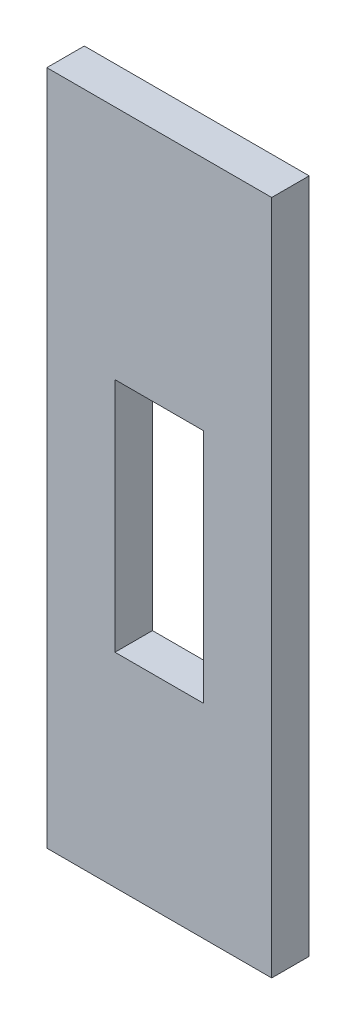
ISO-10303-21;
HEADER;
FILE_DESCRIPTION(('STEP AP214'),'2;1');
FILE_NAME('part.step','',(''),(''),'','','');
FILE_SCHEMA(('AUTOMOTIVE_DESIGN { 1 0 10303 214 1 1 1 1 }'));
ENDSEC;
DATA;
#1=APPLICATION_CONTEXT('core data for automotive mechanical design processes');
#2=APPLICATION_PROTOCOL_DEFINITION('international standard','automotive_design',2000,#1);
#3=PRODUCT_CONTEXT('',#1,'mechanical');
#4=PRODUCT('Part','Part','',(#3));
#5=PRODUCT_RELATED_PRODUCT_CATEGORY('part','',(#4));
#6=PRODUCT_DEFINITION_FORMATION('','',#4);
#7=PRODUCT_DEFINITION_CONTEXT('part definition',#1,'design');
#8=PRODUCT_DEFINITION('design','',#6,#7);
#9=PRODUCT_DEFINITION_SHAPE('','',#8);
#10=(LENGTH_UNIT() NAMED_UNIT(*) SI_UNIT(.MILLI.,.METRE.));
#11=(NAMED_UNIT(*) PLANE_ANGLE_UNIT() SI_UNIT($,.RADIAN.));
#12=(NAMED_UNIT(*) SI_UNIT($,.STERADIAN.) SOLID_ANGLE_UNIT());
#13=UNCERTAINTY_MEASURE_WITH_UNIT(LENGTH_MEASURE(1.E-05),#10,'distance_accuracy_value','');
#14=(GEOMETRIC_REPRESENTATION_CONTEXT(3) GLOBAL_UNCERTAINTY_ASSIGNED_CONTEXT((#13)) GLOBAL_UNIT_ASSIGNED_CONTEXT((#10,
#11,#12)) REPRESENTATION_CONTEXT('',''));
#15=CARTESIAN_POINT('',(0.,0.,0.));
#16=DIRECTION('',(0.,0.,1.));
#17=DIRECTION('',(1.,0.,0.));
#18=AXIS2_PLACEMENT_3D('',#15,#16,#17);
#19=CARTESIAN_POINT('',(0.,0.,6.35));
#20=DIRECTION('',(0.,0.,1.));
#21=DIRECTION('',(1.,0.,0.));
#22=AXIS2_PLACEMENT_3D('',#19,#20,#21);
#23=PLANE('',#22);
#24=DIRECTION('',(0.,1.,0.));
#25=VECTOR('',#24,1.);
#26=CARTESIAN_POINT('',(6.35,-243.893395850462,6.35));
#27=LINE('',#26,#25);
#28=CARTESIAN_POINT('',(6.35,-243.893395850462,6.35));
#29=VERTEX_POINT('',#28);
#30=CARTESIAN_POINT('',(6.35,-129.370585139137,6.35));
#31=VERTEX_POINT('',#30);
#32=EDGE_CURVE('E153',#29,#31,#27,.T.);
#33=ORIENTED_EDGE('',*,*,#32,.T.);
#34=DIRECTION('',(-1.,0.,0.));
#35=VECTOR('',#34,1.);
#36=CARTESIAN_POINT('',(6.35,-129.370585139137,6.35));
#37=LINE('',#36,#35);
#38=CARTESIAN_POINT('',(-31.75,-129.370585139137,6.35));
#39=VERTEX_POINT('',#38);
#40=EDGE_CURVE('E157',#31,#39,#37,.T.);
#41=ORIENTED_EDGE('',*,*,#40,.T.);
#42=DIRECTION('',(0.,-1.,0.));
#43=VECTOR('',#42,1.);
#44=CARTESIAN_POINT('',(-31.75,-243.893395850462,6.35));
#45=LINE('',#44,#43);
#46=CARTESIAN_POINT('',(-31.75,-243.893395850462,6.35));
#47=VERTEX_POINT('',#46);
#48=EDGE_CURVE('E161',#39,#47,#45,.T.);
#49=ORIENTED_EDGE('',*,*,#48,.T.);
#50=DIRECTION('',(1.,0.,0.));
#51=VECTOR('',#50,1.);
#52=CARTESIAN_POINT('',(6.35,-243.893395850462,6.35));
#53=LINE('',#52,#51);
#54=EDGE_CURVE('E164',#47,#29,#53,.T.);
#55=ORIENTED_EDGE('',*,*,#54,.T.);
#56=EDGE_LOOP('',(#33,#41,#49,#55));
#57=FACE_BOUND('',#56,.T.);
#58=DIRECTION('',(1.,0.,0.));
#59=VECTOR('',#58,1.);
#60=CARTESIAN_POINT('',(-20.2,-209.370585139137,6.35));
#61=LINE('',#60,#59);
#62=CARTESIAN_POINT('',(-20.2,-209.370585139137,6.35));
#63=VERTEX_POINT('',#62);
#64=CARTESIAN_POINT('',(-5.19999999999999,-209.370585139137,6.35));
#65=VERTEX_POINT('',#64);
#66=EDGE_CURVE('E114',#63,#65,#61,.T.);
#67=ORIENTED_EDGE('',*,*,#66,.F.);
#68=DIRECTION('',(0.,-1.,0.));
#69=VECTOR('',#68,1.);
#70=CARTESIAN_POINT('',(-20.2,-169.370585139137,6.35));
#71=LINE('',#70,#69);
#72=CARTESIAN_POINT('',(-20.2,-169.370585139137,6.35));
#73=VERTEX_POINT('',#72);
#74=EDGE_CURVE('E105',#73,#63,#71,.T.);
#75=ORIENTED_EDGE('',*,*,#74,.F.);
#76=DIRECTION('',(-1.,0.,0.));
#77=VECTOR('',#76,1.);
#78=CARTESIAN_POINT('',(-20.2,-169.370585139137,6.35));
#79=LINE('',#78,#77);
#80=CARTESIAN_POINT('',(-5.2,-169.370585139137,6.35));
#81=VERTEX_POINT('',#80);
#82=EDGE_CURVE('E131',#81,#73,#79,.T.);
#83=ORIENTED_EDGE('',*,*,#82,.F.);
#84=DIRECTION('',(0.,1.,0.));
#85=VECTOR('',#84,1.);
#86=CARTESIAN_POINT('',(-5.2,-169.370585139137,6.35));
#87=LINE('',#86,#85);
#88=EDGE_CURVE('E127',#65,#81,#87,.T.);
#89=ORIENTED_EDGE('',*,*,#88,.F.);
#90=EDGE_LOOP('',(#67,#75,#83,#89));
#91=FACE_BOUND('',#90,.T.);
#92=ADVANCED_FACE('F39',(#57,#91),#23,.T.);
#93=CARTESIAN_POINT('',(0.,0.,0.));
#94=DIRECTION('',(0.,0.,1.));
#95=DIRECTION('',(1.,0.,0.));
#96=AXIS2_PLACEMENT_3D('',#93,#94,#95);
#97=PLANE('',#96);
#98=DIRECTION('',(0.,1.,0.));
#99=VECTOR('',#98,1.);
#100=CARTESIAN_POINT('',(6.35,-243.893395850462,0.));
#101=LINE('',#100,#99);
#102=CARTESIAN_POINT('',(6.35,-243.893395850462,0.));
#103=VERTEX_POINT('',#102);
#104=CARTESIAN_POINT('',(6.35,-129.370585139137,0.));
#105=VERTEX_POINT('',#104);
#106=EDGE_CURVE('E123',#103,#105,#101,.T.);
#107=ORIENTED_EDGE('',*,*,#106,.F.);
#108=DIRECTION('',(1.,0.,0.));
#109=VECTOR('',#108,1.);
#110=CARTESIAN_POINT('',(6.35,-243.893395850462,0.));
#111=LINE('',#110,#109);
#112=CARTESIAN_POINT('',(-31.75,-243.893395850462,0.));
#113=VERTEX_POINT('',#112);
#114=EDGE_CURVE('E158',#113,#103,#111,.T.);
#115=ORIENTED_EDGE('',*,*,#114,.F.);
#116=DIRECTION('',(0.,-1.,0.));
#117=VECTOR('',#116,1.);
#118=CARTESIAN_POINT('',(-31.75,-243.893395850462,0.));
#119=LINE('',#118,#117);
#120=CARTESIAN_POINT('',(-31.75,-129.370585139137,0.));
#121=VERTEX_POINT('',#120);
#122=EDGE_CURVE('E174',#121,#113,#119,.T.);
#123=ORIENTED_EDGE('',*,*,#122,.F.);
#124=DIRECTION('',(-1.,0.,0.));
#125=VECTOR('',#124,1.);
#126=CARTESIAN_POINT('',(6.35,-129.370585139137,0.));
#127=LINE('',#126,#125);
#128=EDGE_CURVE('E171',#105,#121,#127,.T.);
#129=ORIENTED_EDGE('',*,*,#128,.F.);
#130=EDGE_LOOP('',(#107,#115,#123,#129));
#131=FACE_BOUND('',#130,.T.);
#132=DIRECTION('',(0.,-1.,0.));
#133=VECTOR('',#132,1.);
#134=CARTESIAN_POINT('',(-20.2,-169.370585139137,0.));
#135=LINE('',#134,#133);
#136=CARTESIAN_POINT('',(-20.2,-169.370585139137,0.));
#137=VERTEX_POINT('',#136);
#138=CARTESIAN_POINT('',(-20.2,-209.370585139137,0.));
#139=VERTEX_POINT('',#138);
#140=EDGE_CURVE('E63',#137,#139,#135,.T.);
#141=ORIENTED_EDGE('',*,*,#140,.T.);
#142=DIRECTION('',(1.,0.,0.));
#143=VECTOR('',#142,1.);
#144=CARTESIAN_POINT('',(-20.2,-209.370585139137,0.));
#145=LINE('',#144,#143);
#146=CARTESIAN_POINT('',(-5.19999999999999,-209.370585139137,0.));
#147=VERTEX_POINT('',#146);
#148=EDGE_CURVE('E121',#139,#147,#145,.T.);
#149=ORIENTED_EDGE('',*,*,#148,.T.);
#150=DIRECTION('',(0.,1.,0.));
#151=VECTOR('',#150,1.);
#152=CARTESIAN_POINT('',(-5.2,-169.370585139137,0.));
#153=LINE('',#152,#151);
#154=CARTESIAN_POINT('',(-5.2,-169.370585139137,0.));
#155=VERTEX_POINT('',#154);
#156=EDGE_CURVE('E140',#147,#155,#153,.T.);
#157=ORIENTED_EDGE('',*,*,#156,.T.);
#158=DIRECTION('',(-1.,0.,0.));
#159=VECTOR('',#158,1.);
#160=CARTESIAN_POINT('',(-20.2,-169.370585139137,0.));
#161=LINE('',#160,#159);
#162=EDGE_CURVE('E115',#155,#137,#161,.T.);
#163=ORIENTED_EDGE('',*,*,#162,.T.);
#164=EDGE_LOOP('',(#141,#149,#157,#163));
#165=FACE_BOUND('',#164,.T.);
#166=ADVANCED_FACE('F197',(#131,#165),#97,.F.);
#167=CARTESIAN_POINT('',(6.35,-243.893395850462,6.35));
#168=DIRECTION('',(-1.,0.,0.));
#169=DIRECTION('',(0.,0.,1.));
#170=AXIS2_PLACEMENT_3D('',#167,#168,#169);
#171=PLANE('',#170);
#172=ORIENTED_EDGE('',*,*,#106,.T.);
#173=DIRECTION('',(0.,0.,-1.));
#174=VECTOR('',#173,1.);
#175=CARTESIAN_POINT('',(6.35,-129.370585139137,6.35));
#176=LINE('',#175,#174);
#177=EDGE_CURVE('E11',#31,#105,#176,.T.);
#178=ORIENTED_EDGE('',*,*,#177,.F.);
#179=ORIENTED_EDGE('',*,*,#32,.F.);
#180=DIRECTION('',(0.,0.,-1.));
#181=VECTOR('',#180,1.);
#182=CARTESIAN_POINT('',(6.35,-243.893395850462,6.35));
#183=LINE('',#182,#181);
#184=EDGE_CURVE('E167',#29,#103,#183,.T.);
#185=ORIENTED_EDGE('',*,*,#184,.T.);
#186=EDGE_LOOP('',(#172,#178,#179,#185));
#187=FACE_BOUND('',#186,.T.);
#188=ADVANCED_FACE('F41',(#187),#171,.F.);
#189=CARTESIAN_POINT('',(6.35,-129.370585139137,6.35));
#190=DIRECTION('',(0.,-1.,0.));
#191=DIRECTION('',(0.,0.,-1.));
#192=AXIS2_PLACEMENT_3D('',#189,#190,#191);
#193=PLANE('',#192);
#194=ORIENTED_EDGE('',*,*,#128,.T.);
#195=DIRECTION('',(0.,0.,-1.));
#196=VECTOR('',#195,1.);
#197=CARTESIAN_POINT('',(-31.75,-129.370585139137,6.35));
#198=LINE('',#197,#196);
#199=EDGE_CURVE('E48',#39,#121,#198,.T.);
#200=ORIENTED_EDGE('',*,*,#199,.F.);
#201=ORIENTED_EDGE('',*,*,#40,.F.);
#202=ORIENTED_EDGE('',*,*,#177,.T.);
#203=EDGE_LOOP('',(#194,#200,#201,#202));
#204=FACE_BOUND('',#203,.T.);
#205=ADVANCED_FACE('F207',(#204),#193,.F.);
#206=CARTESIAN_POINT('',(-31.75,-243.893395850462,6.35));
#207=DIRECTION('',(1.,0.,0.));
#208=DIRECTION('',(0.,0.,-1.));
#209=AXIS2_PLACEMENT_3D('',#206,#207,#208);
#210=PLANE('',#209);
#211=ORIENTED_EDGE('',*,*,#122,.T.);
#212=DIRECTION('',(0.,0.,-1.));
#213=VECTOR('',#212,1.);
#214=CARTESIAN_POINT('',(-31.75,-243.893395850462,6.35));
#215=LINE('',#214,#213);
#216=EDGE_CURVE('E182',#47,#113,#215,.T.);
#217=ORIENTED_EDGE('',*,*,#216,.F.);
#218=ORIENTED_EDGE('',*,*,#48,.F.);
#219=ORIENTED_EDGE('',*,*,#199,.T.);
#220=EDGE_LOOP('',(#211,#217,#218,#219));
#221=FACE_BOUND('',#220,.T.);
#222=ADVANCED_FACE('F191',(#221),#210,.F.);
#223=CARTESIAN_POINT('',(6.35,-243.893395850462,6.35));
#224=DIRECTION('',(0.,1.,0.));
#225=DIRECTION('',(0.,0.,1.));
#226=AXIS2_PLACEMENT_3D('',#223,#224,#225);
#227=PLANE('',#226);
#228=ORIENTED_EDGE('',*,*,#114,.T.);
#229=ORIENTED_EDGE('',*,*,#184,.F.);
#230=ORIENTED_EDGE('',*,*,#54,.F.);
#231=ORIENTED_EDGE('',*,*,#216,.T.);
#232=EDGE_LOOP('',(#228,#229,#230,#231));
#233=FACE_BOUND('',#232,.T.);
#234=ADVANCED_FACE('F201',(#233),#227,.F.);
#235=CARTESIAN_POINT('',(-20.2,-169.370585139137,6.35));
#236=DIRECTION('',(1.,0.,0.));
#237=DIRECTION('',(0.,1.,0.));
#238=AXIS2_PLACEMENT_3D('',#235,#236,#237);
#239=PLANE('',#238);
#240=ORIENTED_EDGE('',*,*,#140,.F.);
#241=DIRECTION('',(0.,0.,-1.));
#242=VECTOR('',#241,1.);
#243=CARTESIAN_POINT('',(-20.2,-169.370585139137,6.35));
#244=LINE('',#243,#242);
#245=EDGE_CURVE('E109',#73,#137,#244,.T.);
#246=ORIENTED_EDGE('',*,*,#245,.F.);
#247=ORIENTED_EDGE('',*,*,#74,.T.);
#248=DIRECTION('',(0.,0.,-1.));
#249=VECTOR('',#248,1.);
#250=CARTESIAN_POINT('',(-20.2,-209.370585139137,6.35));
#251=LINE('',#250,#249);
#252=EDGE_CURVE('E108',#63,#139,#251,.T.);
#253=ORIENTED_EDGE('',*,*,#252,.T.);
#254=EDGE_LOOP('',(#240,#246,#247,#253));
#255=FACE_BOUND('',#254,.T.);
#256=ADVANCED_FACE('F107',(#255),#239,.T.);
#257=CARTESIAN_POINT('',(-20.2,-209.370585139137,6.35));
#258=DIRECTION('',(0.,1.,0.));
#259=DIRECTION('',(0.,0.,1.));
#260=AXIS2_PLACEMENT_3D('',#257,#258,#259);
#261=PLANE('',#260);
#262=ORIENTED_EDGE('',*,*,#148,.F.);
#263=ORIENTED_EDGE('',*,*,#252,.F.);
#264=ORIENTED_EDGE('',*,*,#66,.T.);
#265=DIRECTION('',(0.,0.,-1.));
#266=VECTOR('',#265,1.);
#267=CARTESIAN_POINT('',(-5.19999999999999,-209.370585139137,6.35));
#268=LINE('',#267,#266);
#269=EDGE_CURVE('E124',#65,#147,#268,.T.);
#270=ORIENTED_EDGE('',*,*,#269,.T.);
#271=EDGE_LOOP('',(#262,#263,#264,#270));
#272=FACE_BOUND('',#271,.T.);
#273=ADVANCED_FACE('F118',(#272),#261,.T.);
#274=CARTESIAN_POINT('',(-5.2,-169.370585139137,6.35));
#275=DIRECTION('',(-1.,0.,0.));
#276=DIRECTION('',(0.,-1.,0.));
#277=AXIS2_PLACEMENT_3D('',#274,#275,#276);
#278=PLANE('',#277);
#279=ORIENTED_EDGE('',*,*,#156,.F.);
#280=ORIENTED_EDGE('',*,*,#269,.F.);
#281=ORIENTED_EDGE('',*,*,#88,.T.);
#282=DIRECTION('',(0.,0.,-1.));
#283=VECTOR('',#282,1.);
#284=CARTESIAN_POINT('',(-5.2,-169.370585139137,6.35));
#285=LINE('',#284,#283);
#286=EDGE_CURVE('E55',#81,#155,#285,.T.);
#287=ORIENTED_EDGE('',*,*,#286,.T.);
#288=EDGE_LOOP('',(#279,#280,#281,#287));
#289=FACE_BOUND('',#288,.T.);
#290=ADVANCED_FACE('F230',(#289),#278,.T.);
#291=CARTESIAN_POINT('',(-20.2,-169.370585139137,6.35));
#292=DIRECTION('',(0.,-1.,0.));
#293=DIRECTION('',(0.,0.,-1.));
#294=AXIS2_PLACEMENT_3D('',#291,#292,#293);
#295=PLANE('',#294);
#296=ORIENTED_EDGE('',*,*,#162,.F.);
#297=ORIENTED_EDGE('',*,*,#286,.F.);
#298=ORIENTED_EDGE('',*,*,#82,.T.);
#299=ORIENTED_EDGE('',*,*,#245,.T.);
#300=EDGE_LOOP('',(#296,#297,#298,#299));
#301=FACE_BOUND('',#300,.T.);
#302=ADVANCED_FACE('F234',(#301),#295,.T.);
#303=CLOSED_SHELL('',(#92,#166,#188,#205,#222,#234,#256,#273,#290,#302));
#304=MANIFOLD_SOLID_BREP('B2',#303);
#305=ADVANCED_BREP_SHAPE_REPRESENTATION('',(#18,#304),#14);
#306=SHAPE_DEFINITION_REPRESENTATION(#9,#305);
ENDSEC;
END-ISO-10303-21;
